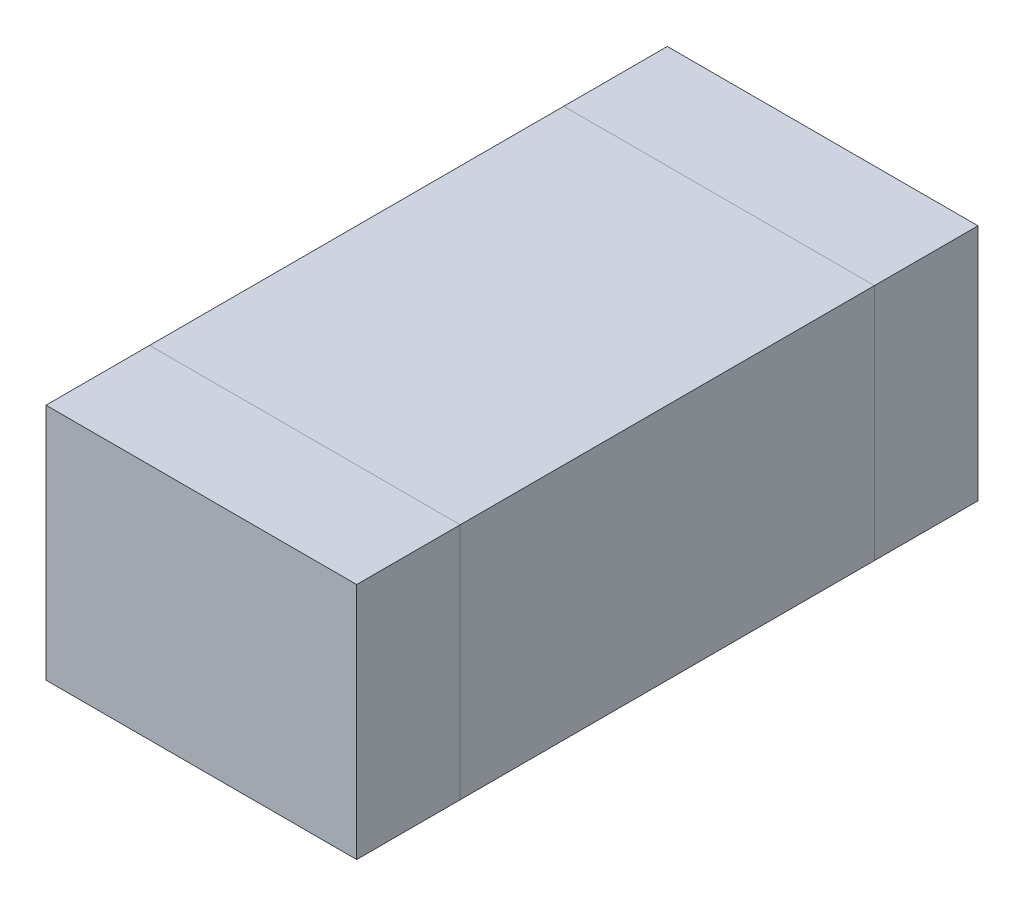
ISO-10303-21;
HEADER;
FILE_DESCRIPTION(('STEP AP214'),'2;1');
FILE_NAME('part.step','',(''),(''),'','','');
FILE_SCHEMA(('AUTOMOTIVE_DESIGN { 1 0 10303 214 1 1 1 1 }'));
ENDSEC;
DATA;
#1=APPLICATION_CONTEXT('core data for automotive mechanical design processes');
#2=APPLICATION_PROTOCOL_DEFINITION('international standard','automotive_design',2000,#1);
#3=PRODUCT_CONTEXT('',#1,'mechanical');
#4=PRODUCT('Part','Part','',(#3));
#5=PRODUCT_RELATED_PRODUCT_CATEGORY('part','',(#4));
#6=PRODUCT_DEFINITION_FORMATION('','',#4);
#7=PRODUCT_DEFINITION_CONTEXT('part definition',#1,'design');
#8=PRODUCT_DEFINITION('design','',#6,#7);
#9=PRODUCT_DEFINITION_SHAPE('','',#8);
#10=(LENGTH_UNIT() NAMED_UNIT(*) SI_UNIT(.MILLI.,.METRE.));
#11=(NAMED_UNIT(*) PLANE_ANGLE_UNIT() SI_UNIT($,.RADIAN.));
#12=(NAMED_UNIT(*) SI_UNIT($,.STERADIAN.) SOLID_ANGLE_UNIT());
#13=UNCERTAINTY_MEASURE_WITH_UNIT(LENGTH_MEASURE(1.E-05),#10,'distance_accuracy_value','');
#14=(GEOMETRIC_REPRESENTATION_CONTEXT(3) GLOBAL_UNCERTAINTY_ASSIGNED_CONTEXT((#13)) GLOBAL_UNIT_ASSIGNED_CONTEXT((#10,
#11,#12)) REPRESENTATION_CONTEXT('',''));
#15=CARTESIAN_POINT('',(0.,0.,0.));
#16=DIRECTION('',(0.,0.,1.));
#17=DIRECTION('',(1.,0.,0.));
#18=AXIS2_PLACEMENT_3D('',#15,#16,#17);
#19=CARTESIAN_POINT('',(-0.15,0.546227766016838,-0.2));
#20=DIRECTION('',(0.,0.,1.));
#21=DIRECTION('',(1.,0.,0.));
#22=AXIS2_PLACEMENT_3D('',#19,#20,#21);
#23=PLANE('',#22);
#24=DIRECTION('',(0.,1.,0.));
#25=VECTOR('',#24,1.);
#26=CARTESIAN_POINT('',(-0.15,0.546227766016838,-0.2));
#27=LINE('',#26,#25);
#28=CARTESIAN_POINT('',(-0.15,0.,-0.2));
#29=VERTEX_POINT('',#28);
#30=CARTESIAN_POINT('',(-0.15,0.23,-0.2));
#31=VERTEX_POINT('',#30);
#32=EDGE_CURVE('P0_E20',#29,#31,#27,.T.);
#33=ORIENTED_EDGE('',*,*,#32,.F.);
#34=DIRECTION('',(1.,0.,0.));
#35=VECTOR('',#34,1.);
#36=CARTESIAN_POINT('',(0.,0.,-0.2));
#37=LINE('',#36,#35);
#38=CARTESIAN_POINT('',(0.15,0.,-0.2));
#39=VERTEX_POINT('',#38);
#40=EDGE_CURVE('P0_E81',#39,#29,#37,.F.);
#41=ORIENTED_EDGE('',*,*,#40,.F.);
#42=DIRECTION('',(0.,1.,0.));
#43=VECTOR('',#42,1.);
#44=CARTESIAN_POINT('',(0.15,0.546227766016838,-0.2));
#45=LINE('',#44,#43);
#46=CARTESIAN_POINT('',(0.15,0.23,-0.2));
#47=VERTEX_POINT('',#46);
#48=EDGE_CURVE('P0_E68',#47,#39,#45,.F.);
#49=ORIENTED_EDGE('',*,*,#48,.F.);
#50=DIRECTION('',(1.,0.,0.));
#51=VECTOR('',#50,1.);
#52=CARTESIAN_POINT('',(0.,0.23,-0.2));
#53=LINE('',#52,#51);
#54=EDGE_CURVE('P0_E55',#31,#47,#53,.T.);
#55=ORIENTED_EDGE('',*,*,#54,.F.);
#56=EDGE_LOOP('',(#33,#41,#49,#55));
#57=FACE_BOUND('',#56,.T.);
#58=ADVANCED_FACE('P0_F17',(#57),#23,.T.);
#59=CARTESIAN_POINT('',(-0.15,0.546227766016838,-0.2));
#60=DIRECTION('',(-1.,0.,0.));
#61=DIRECTION('',(0.,0.,1.));
#62=AXIS2_PLACEMENT_3D('',#59,#60,#61);
#63=PLANE('',#62);
#64=DIRECTION('',(0.,1.,0.));
#65=VECTOR('',#64,1.);
#66=CARTESIAN_POINT('',(-0.15,0.546227766016838,-0.3));
#67=LINE('',#66,#65);
#68=CARTESIAN_POINT('',(-0.15,0.,-0.3));
#69=VERTEX_POINT('',#68);
#70=CARTESIAN_POINT('',(-0.15,0.23,-0.3));
#71=VERTEX_POINT('',#70);
#72=EDGE_CURVE('P0_E83',#69,#71,#67,.T.);
#73=ORIENTED_EDGE('',*,*,#72,.F.);
#74=DIRECTION('',(0.,0.,-1.));
#75=VECTOR('',#74,1.);
#76=CARTESIAN_POINT('',(-0.15,0.,0.));
#77=LINE('',#76,#75);
#78=EDGE_CURVE('P0_E64',#29,#69,#77,.T.);
#79=ORIENTED_EDGE('',*,*,#78,.F.);
#80=ORIENTED_EDGE('',*,*,#32,.T.);
#81=DIRECTION('',(0.,0.,1.));
#82=VECTOR('',#81,1.);
#83=CARTESIAN_POINT('',(-0.15,0.23,0.));
#84=LINE('',#83,#82);
#85=EDGE_CURVE('P0_E61',#71,#31,#84,.T.);
#86=ORIENTED_EDGE('',*,*,#85,.F.);
#87=EDGE_LOOP('',(#73,#79,#80,#86));
#88=FACE_BOUND('',#87,.T.);
#89=ADVANCED_FACE('P0_F60',(#88),#63,.T.);
#90=CARTESIAN_POINT('',(0.,0.23,0.));
#91=DIRECTION('',(0.,1.,0.));
#92=DIRECTION('',(0.,0.,1.));
#93=AXIS2_PLACEMENT_3D('',#90,#91,#92);
#94=PLANE('',#93);
#95=DIRECTION('',(0.,0.,-1.));
#96=VECTOR('',#95,1.);
#97=CARTESIAN_POINT('',(0.15,0.23,-0.2));
#98=LINE('',#97,#96);
#99=CARTESIAN_POINT('',(0.15,0.23,-0.3));
#100=VERTEX_POINT('',#99);
#101=EDGE_CURVE('P0_E70',#100,#47,#98,.F.);
#102=ORIENTED_EDGE('',*,*,#101,.F.);
#103=DIRECTION('',(-1.,0.,0.));
#104=VECTOR('',#103,1.);
#105=CARTESIAN_POINT('',(-0.15,0.23,-0.3));
#106=LINE('',#105,#104);
#107=EDGE_CURVE('P0_E74',#71,#100,#106,.F.);
#108=ORIENTED_EDGE('',*,*,#107,.F.);
#109=ORIENTED_EDGE('',*,*,#85,.T.);
#110=ORIENTED_EDGE('',*,*,#54,.T.);
#111=EDGE_LOOP('',(#102,#108,#109,#110));
#112=FACE_BOUND('',#111,.T.);
#113=ADVANCED_FACE('P0_F72',(#112),#94,.T.);
#114=CARTESIAN_POINT('',(0.15,0.546227766016838,-0.2));
#115=DIRECTION('',(1.,0.,0.));
#116=DIRECTION('',(0.,0.,-1.));
#117=AXIS2_PLACEMENT_3D('',#114,#115,#116);
#118=PLANE('',#117);
#119=ORIENTED_EDGE('',*,*,#48,.T.);
#120=DIRECTION('',(0.,0.,-1.));
#121=VECTOR('',#120,1.);
#122=CARTESIAN_POINT('',(0.15,0.,0.));
#123=LINE('',#122,#121);
#124=CARTESIAN_POINT('',(0.15,0.,-0.3));
#125=VERTEX_POINT('',#124);
#126=EDGE_CURVE('P0_E35',#125,#39,#123,.F.);
#127=ORIENTED_EDGE('',*,*,#126,.F.);
#128=DIRECTION('',(0.,1.,0.));
#129=VECTOR('',#128,1.);
#130=CARTESIAN_POINT('',(0.15,0.546227766016838,-0.3));
#131=LINE('',#130,#129);
#132=EDGE_CURVE('P0_E26',#100,#125,#131,.F.);
#133=ORIENTED_EDGE('',*,*,#132,.F.);
#134=ORIENTED_EDGE('',*,*,#101,.T.);
#135=EDGE_LOOP('',(#119,#127,#133,#134));
#136=FACE_BOUND('',#135,.T.);
#137=ADVANCED_FACE('P0_F89',(#136),#118,.T.);
#138=CARTESIAN_POINT('',(0.,0.,0.));
#139=DIRECTION('',(0.,-1.,0.));
#140=DIRECTION('',(0.,0.,-1.));
#141=AXIS2_PLACEMENT_3D('',#138,#139,#140);
#142=PLANE('',#141);
#143=ORIENTED_EDGE('',*,*,#126,.T.);
#144=ORIENTED_EDGE('',*,*,#40,.T.);
#145=ORIENTED_EDGE('',*,*,#78,.T.);
#146=DIRECTION('',(-1.,0.,0.));
#147=VECTOR('',#146,1.);
#148=CARTESIAN_POINT('',(-0.15,0.,-0.3));
#149=LINE('',#148,#147);
#150=EDGE_CURVE('P0_E11',#125,#69,#149,.T.);
#151=ORIENTED_EDGE('',*,*,#150,.F.);
#152=EDGE_LOOP('',(#143,#144,#145,#151));
#153=FACE_BOUND('',#152,.T.);
#154=ADVANCED_FACE('P0_F91',(#153),#142,.T.);
#155=CARTESIAN_POINT('',(-0.15,0.546227766016838,-0.3));
#156=DIRECTION('',(0.,0.,-1.));
#157=DIRECTION('',(-1.,0.,0.));
#158=AXIS2_PLACEMENT_3D('',#155,#156,#157);
#159=PLANE('',#158);
#160=ORIENTED_EDGE('',*,*,#132,.T.);
#161=ORIENTED_EDGE('',*,*,#150,.T.);
#162=ORIENTED_EDGE('',*,*,#72,.T.);
#163=ORIENTED_EDGE('',*,*,#107,.T.);
#164=EDGE_LOOP('',(#160,#161,#162,#163));
#165=FACE_BOUND('',#164,.T.);
#166=ADVANCED_FACE('P0_F88',(#165),#159,.T.);
#167=CLOSED_SHELL('',(#58,#89,#113,#137,#154,#166));
#168=MANIFOLD_SOLID_BREP('P0_B1',#167);
#169=CARTESIAN_POINT('',(0.,0.,0.));
#170=DIRECTION('',(0.,1.,0.));
#171=DIRECTION('',(0.,0.,1.));
#172=AXIS2_PLACEMENT_3D('',#169,#170,#171);
#173=PLANE('',#172);
#174=DIRECTION('',(-1.,0.,0.));
#175=VECTOR('',#174,1.);
#176=CARTESIAN_POINT('',(-0.15,0.,0.2));
#177=LINE('',#176,#175);
#178=CARTESIAN_POINT('',(0.15,0.,0.2));
#179=VERTEX_POINT('',#178);
#180=CARTESIAN_POINT('',(-0.15,0.,0.2));
#181=VERTEX_POINT('',#180);
#182=EDGE_CURVE('P1_E81',#179,#181,#177,.T.);
#183=ORIENTED_EDGE('',*,*,#182,.T.);
#184=DIRECTION('',(0.,0.,-1.));
#185=VECTOR('',#184,1.);
#186=CARTESIAN_POINT('',(-0.15,0.,-0.2));
#187=LINE('',#186,#185);
#188=CARTESIAN_POINT('',(-0.15,0.,-0.2));
#189=VERTEX_POINT('',#188);
#190=EDGE_CURVE('P1_E68',#181,#189,#187,.T.);
#191=ORIENTED_EDGE('',*,*,#190,.T.);
#192=DIRECTION('',(1.,0.,0.));
#193=VECTOR('',#192,1.);
#194=CARTESIAN_POINT('',(-0.15,0.,-0.2));
#195=LINE('',#194,#193);
#196=CARTESIAN_POINT('',(0.15,0.,-0.2));
#197=VERTEX_POINT('',#196);
#198=EDGE_CURVE('P1_E55',#189,#197,#195,.T.);
#199=ORIENTED_EDGE('',*,*,#198,.T.);
#200=DIRECTION('',(0.,0.,1.));
#201=VECTOR('',#200,1.);
#202=CARTESIAN_POINT('',(0.15,0.,-0.2));
#203=LINE('',#202,#201);
#204=EDGE_CURVE('P1_E20',#197,#179,#203,.T.);
#205=ORIENTED_EDGE('',*,*,#204,.T.);
#206=EDGE_LOOP('',(#183,#191,#199,#205));
#207=FACE_BOUND('',#206,.T.);
#208=ADVANCED_FACE('P1_F17',(#207),#173,.F.);
#209=CARTESIAN_POINT('',(0.15,0.23,-0.2));
#210=DIRECTION('',(-1.,0.,0.));
#211=DIRECTION('',(0.,0.,1.));
#212=AXIS2_PLACEMENT_3D('',#209,#210,#211);
#213=PLANE('',#212);
#214=DIRECTION('',(0.,1.,0.));
#215=VECTOR('',#214,1.);
#216=CARTESIAN_POINT('',(0.15,0.23,-0.2));
#217=LINE('',#216,#215);
#218=CARTESIAN_POINT('',(0.15,0.23,-0.2));
#219=VERTEX_POINT('',#218);
#220=EDGE_CURVE('P1_E61',#197,#219,#217,.T.);
#221=ORIENTED_EDGE('',*,*,#220,.T.);
#222=DIRECTION('',(0.,0.,1.));
#223=VECTOR('',#222,1.);
#224=CARTESIAN_POINT('',(0.15,0.23,0.));
#225=LINE('',#224,#223);
#226=CARTESIAN_POINT('',(0.15,0.23,0.2));
#227=VERTEX_POINT('',#226);
#228=EDGE_CURVE('P1_E83',#227,#219,#225,.F.);
#229=ORIENTED_EDGE('',*,*,#228,.F.);
#230=DIRECTION('',(0.,1.,0.));
#231=VECTOR('',#230,1.);
#232=CARTESIAN_POINT('',(0.15,0.23,0.2));
#233=LINE('',#232,#231);
#234=EDGE_CURVE('P1_E64',#227,#179,#233,.F.);
#235=ORIENTED_EDGE('',*,*,#234,.T.);
#236=ORIENTED_EDGE('',*,*,#204,.F.);
#237=EDGE_LOOP('',(#221,#229,#235,#236));
#238=FACE_BOUND('',#237,.T.);
#239=ADVANCED_FACE('P1_F60',(#238),#213,.F.);
#240=CARTESIAN_POINT('',(-0.15,0.23,-0.2));
#241=DIRECTION('',(0.,0.,1.));
#242=DIRECTION('',(1.,0.,0.));
#243=AXIS2_PLACEMENT_3D('',#240,#241,#242);
#244=PLANE('',#243);
#245=DIRECTION('',(0.,1.,0.));
#246=VECTOR('',#245,1.);
#247=CARTESIAN_POINT('',(-0.15,0.23,-0.2));
#248=LINE('',#247,#246);
#249=CARTESIAN_POINT('',(-0.15,0.23,-0.2));
#250=VERTEX_POINT('',#249);
#251=EDGE_CURVE('P1_E70',#189,#250,#248,.T.);
#252=ORIENTED_EDGE('',*,*,#251,.T.);
#253=DIRECTION('',(1.,0.,0.));
#254=VECTOR('',#253,1.);
#255=CARTESIAN_POINT('',(0.,0.23,-0.2));
#256=LINE('',#255,#254);
#257=EDGE_CURVE('P1_E74',#219,#250,#256,.F.);
#258=ORIENTED_EDGE('',*,*,#257,.F.);
#259=ORIENTED_EDGE('',*,*,#220,.F.);
#260=ORIENTED_EDGE('',*,*,#198,.F.);
#261=EDGE_LOOP('',(#252,#258,#259,#260));
#262=FACE_BOUND('',#261,.T.);
#263=ADVANCED_FACE('P1_F72',(#262),#244,.F.);
#264=CARTESIAN_POINT('',(-0.15,0.23,-0.2));
#265=DIRECTION('',(1.,0.,0.));
#266=DIRECTION('',(0.,0.,-1.));
#267=AXIS2_PLACEMENT_3D('',#264,#265,#266);
#268=PLANE('',#267);
#269=DIRECTION('',(0.,1.,0.));
#270=VECTOR('',#269,1.);
#271=CARTESIAN_POINT('',(-0.15,0.23,0.2));
#272=LINE('',#271,#270);
#273=CARTESIAN_POINT('',(-0.15,0.23,0.2));
#274=VERTEX_POINT('',#273);
#275=EDGE_CURVE('P1_E35',#181,#274,#272,.T.);
#276=ORIENTED_EDGE('',*,*,#275,.T.);
#277=DIRECTION('',(0.,0.,1.));
#278=VECTOR('',#277,1.);
#279=CARTESIAN_POINT('',(-0.15,0.23,0.));
#280=LINE('',#279,#278);
#281=EDGE_CURVE('P1_E26',#250,#274,#280,.T.);
#282=ORIENTED_EDGE('',*,*,#281,.F.);
#283=ORIENTED_EDGE('',*,*,#251,.F.);
#284=ORIENTED_EDGE('',*,*,#190,.F.);
#285=EDGE_LOOP('',(#276,#282,#283,#284));
#286=FACE_BOUND('',#285,.T.);
#287=ADVANCED_FACE('P1_F89',(#286),#268,.F.);
#288=CARTESIAN_POINT('',(-0.15,0.23,0.2));
#289=DIRECTION('',(0.,0.,-1.));
#290=DIRECTION('',(-1.,0.,0.));
#291=AXIS2_PLACEMENT_3D('',#288,#289,#290);
#292=PLANE('',#291);
#293=ORIENTED_EDGE('',*,*,#234,.F.);
#294=DIRECTION('',(1.,0.,0.));
#295=VECTOR('',#294,1.);
#296=CARTESIAN_POINT('',(0.,0.23,0.2));
#297=LINE('',#296,#295);
#298=EDGE_CURVE('P1_E11',#274,#227,#297,.T.);
#299=ORIENTED_EDGE('',*,*,#298,.F.);
#300=ORIENTED_EDGE('',*,*,#275,.F.);
#301=ORIENTED_EDGE('',*,*,#182,.F.);
#302=EDGE_LOOP('',(#293,#299,#300,#301));
#303=FACE_BOUND('',#302,.T.);
#304=ADVANCED_FACE('P1_F91',(#303),#292,.F.);
#305=CARTESIAN_POINT('',(0.,0.23,0.));
#306=DIRECTION('',(0.,1.,0.));
#307=DIRECTION('',(0.,0.,1.));
#308=AXIS2_PLACEMENT_3D('',#305,#306,#307);
#309=PLANE('',#308);
#310=ORIENTED_EDGE('',*,*,#281,.T.);
#311=ORIENTED_EDGE('',*,*,#298,.T.);
#312=ORIENTED_EDGE('',*,*,#228,.T.);
#313=ORIENTED_EDGE('',*,*,#257,.T.);
#314=EDGE_LOOP('',(#310,#311,#312,#313));
#315=FACE_BOUND('',#314,.T.);
#316=ADVANCED_FACE('P1_F88',(#315),#309,.T.);
#317=CLOSED_SHELL('',(#208,#239,#263,#287,#304,#316));
#318=MANIFOLD_SOLID_BREP('P1_B1',#317);
#319=CARTESIAN_POINT('',(-0.15,0.546227766016838,0.3));
#320=DIRECTION('',(0.,0.,1.));
#321=DIRECTION('',(1.,0.,0.));
#322=AXIS2_PLACEMENT_3D('',#319,#320,#321);
#323=PLANE('',#322);
#324=DIRECTION('',(0.,1.,0.));
#325=VECTOR('',#324,1.);
#326=CARTESIAN_POINT('',(-0.15,0.546227766016838,0.3));
#327=LINE('',#326,#325);
#328=CARTESIAN_POINT('',(-0.15,0.,0.3));
#329=VERTEX_POINT('',#328);
#330=CARTESIAN_POINT('',(-0.15,0.23,0.3));
#331=VERTEX_POINT('',#330);
#332=EDGE_CURVE('P2_E20',#329,#331,#327,.T.);
#333=ORIENTED_EDGE('',*,*,#332,.F.);
#334=DIRECTION('',(1.,0.,0.));
#335=VECTOR('',#334,1.);
#336=CARTESIAN_POINT('',(0.,0.,0.3));
#337=LINE('',#336,#335);
#338=CARTESIAN_POINT('',(0.15,0.,0.3));
#339=VERTEX_POINT('',#338);
#340=EDGE_CURVE('P2_E79',#329,#339,#337,.T.);
#341=ORIENTED_EDGE('',*,*,#340,.T.);
#342=DIRECTION('',(0.,1.,0.));
#343=VECTOR('',#342,1.);
#344=CARTESIAN_POINT('',(0.15,0.546227766016838,0.3));
#345=LINE('',#344,#343);
#346=CARTESIAN_POINT('',(0.15,0.23,0.3));
#347=VERTEX_POINT('',#346);
#348=EDGE_CURVE('P2_E68',#347,#339,#345,.F.);
#349=ORIENTED_EDGE('',*,*,#348,.F.);
#350=DIRECTION('',(1.,0.,0.));
#351=VECTOR('',#350,1.);
#352=CARTESIAN_POINT('',(0.,0.23,0.3));
#353=LINE('',#352,#351);
#354=EDGE_CURVE('P2_E56',#331,#347,#353,.T.);
#355=ORIENTED_EDGE('',*,*,#354,.F.);
#356=EDGE_LOOP('',(#333,#341,#349,#355));
#357=FACE_BOUND('',#356,.T.);
#358=ADVANCED_FACE('P2_F17',(#357),#323,.T.);
#359=CARTESIAN_POINT('',(-0.15,0.546227766016838,0.2));
#360=DIRECTION('',(-1.,0.,0.));
#361=DIRECTION('',(0.,0.,1.));
#362=AXIS2_PLACEMENT_3D('',#359,#360,#361);
#363=PLANE('',#362);
#364=DIRECTION('',(0.,1.,0.));
#365=VECTOR('',#364,1.);
#366=CARTESIAN_POINT('',(-0.15,0.546227766016838,0.2));
#367=LINE('',#366,#365);
#368=CARTESIAN_POINT('',(-0.15,0.,0.2));
#369=VERTEX_POINT('',#368);
#370=CARTESIAN_POINT('',(-0.15,0.23,0.2));
#371=VERTEX_POINT('',#370);
#372=EDGE_CURVE('P2_E83',#369,#371,#367,.T.);
#373=ORIENTED_EDGE('',*,*,#372,.F.);
#374=DIRECTION('',(0.,0.,1.));
#375=VECTOR('',#374,1.);
#376=CARTESIAN_POINT('',(-0.15,0.,0.));
#377=LINE('',#376,#375);
#378=EDGE_CURVE('P2_E65',#369,#329,#377,.T.);
#379=ORIENTED_EDGE('',*,*,#378,.T.);
#380=ORIENTED_EDGE('',*,*,#332,.T.);
#381=DIRECTION('',(0.,0.,1.));
#382=VECTOR('',#381,1.);
#383=CARTESIAN_POINT('',(-0.15,0.23,0.));
#384=LINE('',#383,#382);
#385=EDGE_CURVE('P2_E62',#371,#331,#384,.T.);
#386=ORIENTED_EDGE('',*,*,#385,.F.);
#387=EDGE_LOOP('',(#373,#379,#380,#386));
#388=FACE_BOUND('',#387,.T.);
#389=ADVANCED_FACE('P2_F61',(#388),#363,.T.);
#390=CARTESIAN_POINT('',(0.,0.23,0.));
#391=DIRECTION('',(0.,1.,0.));
#392=DIRECTION('',(0.,0.,1.));
#393=AXIS2_PLACEMENT_3D('',#390,#391,#392);
#394=PLANE('',#393);
#395=DIRECTION('',(0.,0.,-1.));
#396=VECTOR('',#395,1.);
#397=CARTESIAN_POINT('',(0.15,0.23,0.2));
#398=LINE('',#397,#396);
#399=CARTESIAN_POINT('',(0.15,0.23,0.2));
#400=VERTEX_POINT('',#399);
#401=EDGE_CURVE('P2_E70',#400,#347,#398,.F.);
#402=ORIENTED_EDGE('',*,*,#401,.F.);
#403=DIRECTION('',(-1.,0.,0.));
#404=VECTOR('',#403,1.);
#405=CARTESIAN_POINT('',(-0.15,0.23,0.2));
#406=LINE('',#405,#404);
#407=EDGE_CURVE('P2_E74',#371,#400,#406,.F.);
#408=ORIENTED_EDGE('',*,*,#407,.F.);
#409=ORIENTED_EDGE('',*,*,#385,.T.);
#410=ORIENTED_EDGE('',*,*,#354,.T.);
#411=EDGE_LOOP('',(#402,#408,#409,#410));
#412=FACE_BOUND('',#411,.T.);
#413=ADVANCED_FACE('P2_F72',(#412),#394,.T.);
#414=CARTESIAN_POINT('',(0.15,0.546227766016838,0.2));
#415=DIRECTION('',(1.,0.,0.));
#416=DIRECTION('',(0.,0.,-1.));
#417=AXIS2_PLACEMENT_3D('',#414,#415,#416);
#418=PLANE('',#417);
#419=ORIENTED_EDGE('',*,*,#348,.T.);
#420=DIRECTION('',(0.,0.,1.));
#421=VECTOR('',#420,1.);
#422=CARTESIAN_POINT('',(0.15,0.,0.));
#423=LINE('',#422,#421);
#424=CARTESIAN_POINT('',(0.15,0.,0.2));
#425=VERTEX_POINT('',#424);
#426=EDGE_CURVE('P2_E35',#339,#425,#423,.F.);
#427=ORIENTED_EDGE('',*,*,#426,.T.);
#428=DIRECTION('',(0.,1.,0.));
#429=VECTOR('',#428,1.);
#430=CARTESIAN_POINT('',(0.15,0.546227766016838,0.2));
#431=LINE('',#430,#429);
#432=EDGE_CURVE('P2_E26',#400,#425,#431,.F.);
#433=ORIENTED_EDGE('',*,*,#432,.F.);
#434=ORIENTED_EDGE('',*,*,#401,.T.);
#435=EDGE_LOOP('',(#419,#427,#433,#434));
#436=FACE_BOUND('',#435,.T.);
#437=ADVANCED_FACE('P2_F89',(#436),#418,.T.);
#438=CARTESIAN_POINT('',(0.,0.,0.));
#439=DIRECTION('',(0.,1.,0.));
#440=DIRECTION('',(0.,0.,1.));
#441=AXIS2_PLACEMENT_3D('',#438,#439,#440);
#442=PLANE('',#441);
#443=DIRECTION('',(-1.,0.,0.));
#444=VECTOR('',#443,1.);
#445=CARTESIAN_POINT('',(-0.15,0.,0.2));
#446=LINE('',#445,#444);
#447=EDGE_CURVE('P2_E11',#425,#369,#446,.T.);
#448=ORIENTED_EDGE('',*,*,#447,.F.);
#449=ORIENTED_EDGE('',*,*,#426,.F.);
#450=ORIENTED_EDGE('',*,*,#340,.F.);
#451=ORIENTED_EDGE('',*,*,#378,.F.);
#452=EDGE_LOOP('',(#448,#449,#450,#451));
#453=FACE_BOUND('',#452,.T.);
#454=ADVANCED_FACE('P2_F91',(#453),#442,.F.);
#455=CARTESIAN_POINT('',(-0.15,0.546227766016838,0.2));
#456=DIRECTION('',(0.,0.,-1.));
#457=DIRECTION('',(-1.,0.,0.));
#458=AXIS2_PLACEMENT_3D('',#455,#456,#457);
#459=PLANE('',#458);
#460=ORIENTED_EDGE('',*,*,#432,.T.);
#461=ORIENTED_EDGE('',*,*,#447,.T.);
#462=ORIENTED_EDGE('',*,*,#372,.T.);
#463=ORIENTED_EDGE('',*,*,#407,.T.);
#464=EDGE_LOOP('',(#460,#461,#462,#463));
#465=FACE_BOUND('',#464,.T.);
#466=ADVANCED_FACE('P2_F88',(#465),#459,.T.);
#467=CLOSED_SHELL('',(#358,#389,#413,#437,#454,#466));
#468=MANIFOLD_SOLID_BREP('P2_B1',#467);
#469=ADVANCED_BREP_SHAPE_REPRESENTATION('',(#18,#168,#318,#468),#14);
#470=SHAPE_DEFINITION_REPRESENTATION(#9,#469);
ENDSEC;
END-ISO-10303-21;
